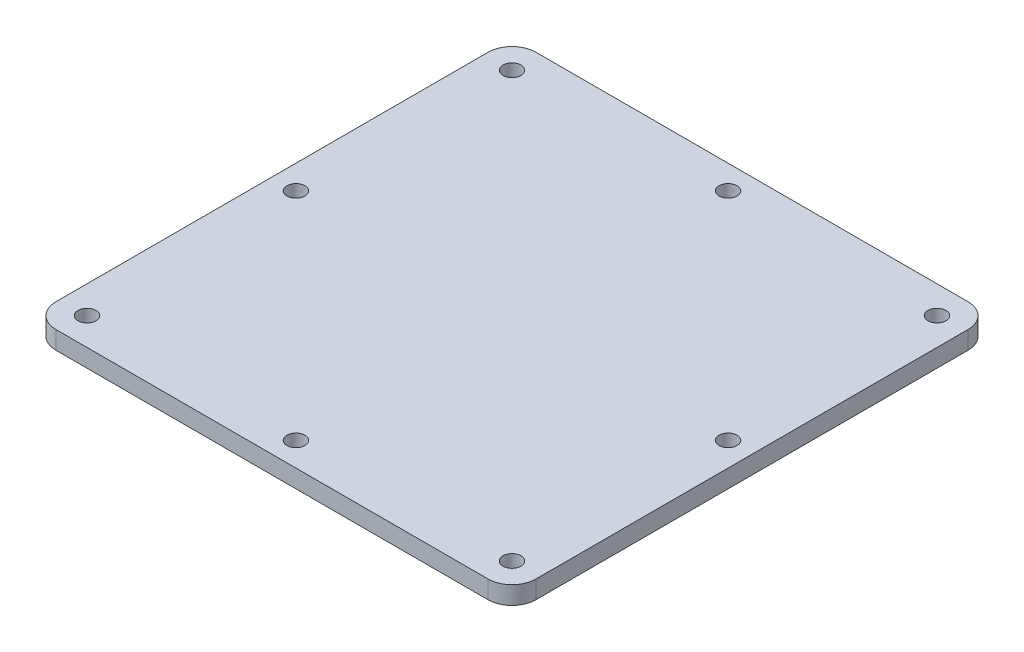
ISO-10303-21;
HEADER;
FILE_DESCRIPTION(('STEP AP214'),'2;1');
FILE_NAME('part.step','',(''),(''),'','','');
FILE_SCHEMA(('AUTOMOTIVE_DESIGN { 1 0 10303 214 1 1 1 1 }'));
ENDSEC;
DATA;
#1=APPLICATION_CONTEXT('core data for automotive mechanical design processes');
#2=APPLICATION_PROTOCOL_DEFINITION('international standard','automotive_design',2000,#1);
#3=PRODUCT_CONTEXT('',#1,'mechanical');
#4=PRODUCT('Part','Part','',(#3));
#5=PRODUCT_RELATED_PRODUCT_CATEGORY('part','',(#4));
#6=PRODUCT_DEFINITION_FORMATION('','',#4);
#7=PRODUCT_DEFINITION_CONTEXT('part definition',#1,'design');
#8=PRODUCT_DEFINITION('design','',#6,#7);
#9=PRODUCT_DEFINITION_SHAPE('','',#8);
#10=(LENGTH_UNIT() NAMED_UNIT(*) SI_UNIT(.MILLI.,.METRE.));
#11=(NAMED_UNIT(*) PLANE_ANGLE_UNIT() SI_UNIT($,.RADIAN.));
#12=(NAMED_UNIT(*) SI_UNIT($,.STERADIAN.) SOLID_ANGLE_UNIT());
#13=UNCERTAINTY_MEASURE_WITH_UNIT(LENGTH_MEASURE(1.E-05),#10,'distance_accuracy_value','');
#14=(GEOMETRIC_REPRESENTATION_CONTEXT(3) GLOBAL_UNCERTAINTY_ASSIGNED_CONTEXT((#13)) GLOBAL_UNIT_ASSIGNED_CONTEXT((#10,
#11,#12)) REPRESENTATION_CONTEXT('',''));
#15=CARTESIAN_POINT('',(0.,0.,0.));
#16=DIRECTION('',(0.,0.,1.));
#17=DIRECTION('',(1.,0.,0.));
#18=AXIS2_PLACEMENT_3D('',#15,#16,#17);
#19=CARTESIAN_POINT('',(40.,3.,-40.));
#20=DIRECTION('',(-1.,0.,0.));
#21=DIRECTION('',(0.,0.,1.));
#22=AXIS2_PLACEMENT_3D('',#19,#20,#21);
#23=PLANE('',#22);
#24=DIRECTION('',(0.,0.,-1.));
#25=VECTOR('',#24,1.);
#26=CARTESIAN_POINT('',(40.,0.,-40.));
#27=LINE('',#26,#25);
#28=CARTESIAN_POINT('',(40.,0.,36.));
#29=VERTEX_POINT('',#28);
#30=CARTESIAN_POINT('',(40.,0.,-36.));
#31=VERTEX_POINT('',#30);
#32=EDGE_CURVE('E132',#29,#31,#27,.T.);
#33=ORIENTED_EDGE('',*,*,#32,.T.);
#34=DIRECTION('',(0.,-1.,0.));
#35=VECTOR('',#34,1.);
#36=CARTESIAN_POINT('',(40.,3.,-36.));
#37=LINE('',#36,#35);
#38=CARTESIAN_POINT('',(40.,3.,-36.));
#39=VERTEX_POINT('',#38);
#40=EDGE_CURVE('E109',#31,#39,#37,.F.);
#41=ORIENTED_EDGE('',*,*,#40,.T.);
#42=DIRECTION('',(0.,0.,-1.));
#43=VECTOR('',#42,1.);
#44=CARTESIAN_POINT('',(40.,3.,-40.));
#45=LINE('',#44,#43);
#46=CARTESIAN_POINT('',(40.,3.,36.));
#47=VERTEX_POINT('',#46);
#48=EDGE_CURVE('E142',#47,#39,#45,.T.);
#49=ORIENTED_EDGE('',*,*,#48,.F.);
#50=DIRECTION('',(0.,-1.,0.));
#51=VECTOR('',#50,1.);
#52=CARTESIAN_POINT('',(40.,3.,36.));
#53=LINE('',#52,#51);
#54=EDGE_CURVE('E114',#47,#29,#53,.T.);
#55=ORIENTED_EDGE('',*,*,#54,.T.);
#56=EDGE_LOOP('',(#33,#41,#49,#55));
#57=FACE_BOUND('',#56,.T.);
#58=ADVANCED_FACE('F37',(#57),#23,.F.);
#59=CARTESIAN_POINT('',(-40.,3.,-40.));
#60=DIRECTION('',(0.,0.,1.));
#61=DIRECTION('',(1.,0.,0.));
#62=AXIS2_PLACEMENT_3D('',#59,#60,#61);
#63=PLANE('',#62);
#64=DIRECTION('',(-1.,0.,0.));
#65=VECTOR('',#64,1.);
#66=CARTESIAN_POINT('',(-40.,3.,-40.));
#67=LINE('',#66,#65);
#68=CARTESIAN_POINT('',(36.,3.,-40.));
#69=VERTEX_POINT('',#68);
#70=CARTESIAN_POINT('',(-36.,3.,-40.));
#71=VERTEX_POINT('',#70);
#72=EDGE_CURVE('E124',#69,#71,#67,.T.);
#73=ORIENTED_EDGE('',*,*,#72,.F.);
#74=DIRECTION('',(0.,-1.,0.));
#75=VECTOR('',#74,1.);
#76=CARTESIAN_POINT('',(36.,3.,-40.));
#77=LINE('',#76,#75);
#78=CARTESIAN_POINT('',(36.,0.,-40.));
#79=VERTEX_POINT('',#78);
#80=EDGE_CURVE('E108',#69,#79,#77,.T.);
#81=ORIENTED_EDGE('',*,*,#80,.T.);
#82=DIRECTION('',(-1.,0.,0.));
#83=VECTOR('',#82,1.);
#84=CARTESIAN_POINT('',(-40.,0.,-40.));
#85=LINE('',#84,#83);
#86=CARTESIAN_POINT('',(-36.,0.,-40.));
#87=VERTEX_POINT('',#86);
#88=EDGE_CURVE('E121',#79,#87,#85,.T.);
#89=ORIENTED_EDGE('',*,*,#88,.T.);
#90=DIRECTION('',(0.,-1.,0.));
#91=VECTOR('',#90,1.);
#92=CARTESIAN_POINT('',(-36.,3.,-40.));
#93=LINE('',#92,#91);
#94=EDGE_CURVE('E126',#87,#71,#93,.F.);
#95=ORIENTED_EDGE('',*,*,#94,.T.);
#96=EDGE_LOOP('',(#73,#81,#89,#95));
#97=FACE_BOUND('',#96,.T.);
#98=ADVANCED_FACE('F120',(#97),#63,.F.);
#99=CARTESIAN_POINT('',(-40.,3.,-40.));
#100=DIRECTION('',(1.,0.,0.));
#101=DIRECTION('',(0.,0.,-1.));
#102=AXIS2_PLACEMENT_3D('',#99,#100,#101);
#103=PLANE('',#102);
#104=DIRECTION('',(0.,0.,1.));
#105=VECTOR('',#104,1.);
#106=CARTESIAN_POINT('',(-40.,3.,-40.));
#107=LINE('',#106,#105);
#108=CARTESIAN_POINT('',(-40.,3.,-36.));
#109=VERTEX_POINT('',#108);
#110=CARTESIAN_POINT('',(-40.,3.,36.));
#111=VERTEX_POINT('',#110);
#112=EDGE_CURVE('E165',#109,#111,#107,.T.);
#113=ORIENTED_EDGE('',*,*,#112,.F.);
#114=DIRECTION('',(0.,-1.,0.));
#115=VECTOR('',#114,1.);
#116=CARTESIAN_POINT('',(-40.,3.,-36.));
#117=LINE('',#116,#115);
#118=CARTESIAN_POINT('',(-40.,0.,-36.));
#119=VERTEX_POINT('',#118);
#120=EDGE_CURVE('E11',#109,#119,#117,.T.);
#121=ORIENTED_EDGE('',*,*,#120,.T.);
#122=DIRECTION('',(0.,0.,1.));
#123=VECTOR('',#122,1.);
#124=CARTESIAN_POINT('',(-40.,0.,-40.));
#125=LINE('',#124,#123);
#126=CARTESIAN_POINT('',(-40.,0.,36.));
#127=VERTEX_POINT('',#126);
#128=EDGE_CURVE('E131',#119,#127,#125,.T.);
#129=ORIENTED_EDGE('',*,*,#128,.T.);
#130=DIRECTION('',(0.,-1.,0.));
#131=VECTOR('',#130,1.);
#132=CARTESIAN_POINT('',(-40.,3.,36.));
#133=LINE('',#132,#131);
#134=EDGE_CURVE('E45',#127,#111,#133,.F.);
#135=ORIENTED_EDGE('',*,*,#134,.T.);
#136=EDGE_LOOP('',(#113,#121,#129,#135));
#137=FACE_BOUND('',#136,.T.);
#138=ADVANCED_FACE('F164',(#137),#103,.F.);
#139=CARTESIAN_POINT('',(-40.,3.,40.));
#140=DIRECTION('',(0.,0.,-1.));
#141=DIRECTION('',(-1.,0.,0.));
#142=AXIS2_PLACEMENT_3D('',#139,#140,#141);
#143=PLANE('',#142);
#144=DIRECTION('',(1.,0.,0.));
#145=VECTOR('',#144,1.);
#146=CARTESIAN_POINT('',(-40.,0.,40.));
#147=LINE('',#146,#145);
#148=CARTESIAN_POINT('',(-36.,0.,40.));
#149=VERTEX_POINT('',#148);
#150=CARTESIAN_POINT('',(36.,0.,40.));
#151=VERTEX_POINT('',#150);
#152=EDGE_CURVE('E135',#149,#151,#147,.T.);
#153=ORIENTED_EDGE('',*,*,#152,.T.);
#154=DIRECTION('',(0.,-1.,0.));
#155=VECTOR('',#154,1.);
#156=CARTESIAN_POINT('',(36.,3.,40.));
#157=LINE('',#156,#155);
#158=CARTESIAN_POINT('',(36.,3.,40.));
#159=VERTEX_POINT('',#158);
#160=EDGE_CURVE('E52',#151,#159,#157,.F.);
#161=ORIENTED_EDGE('',*,*,#160,.T.);
#162=DIRECTION('',(1.,0.,0.));
#163=VECTOR('',#162,1.);
#164=CARTESIAN_POINT('',(-40.,3.,40.));
#165=LINE('',#164,#163);
#166=CARTESIAN_POINT('',(-36.,3.,40.));
#167=VERTEX_POINT('',#166);
#168=EDGE_CURVE('E143',#167,#159,#165,.T.);
#169=ORIENTED_EDGE('',*,*,#168,.F.);
#170=DIRECTION('',(0.,-1.,0.));
#171=VECTOR('',#170,1.);
#172=CARTESIAN_POINT('',(-36.,3.,40.));
#173=LINE('',#172,#171);
#174=EDGE_CURVE('E158',#167,#149,#173,.T.);
#175=ORIENTED_EDGE('',*,*,#174,.T.);
#176=EDGE_LOOP('',(#153,#161,#169,#175));
#177=FACE_BOUND('',#176,.T.);
#178=ADVANCED_FACE('F174',(#177),#143,.F.);
#179=CARTESIAN_POINT('',(0.,3.,0.));
#180=DIRECTION('',(0.,1.,0.));
#181=DIRECTION('',(0.,0.,1.));
#182=AXIS2_PLACEMENT_3D('',#179,#180,#181);
#183=PLANE('',#182);
#184=CARTESIAN_POINT('',(35.4038059222871,3.,35.4038059222878));
#185=DIRECTION('',(0.,1.,0.));
#186=DIRECTION('',(1.,0.,0.));
#187=AXIS2_PLACEMENT_3D('',#184,#185,#186);
#188=CIRCLE('',#187,1.5);
#189=CARTESIAN_POINT('',(36.9038059222871,3.,35.4038059222878));
#190=VERTEX_POINT('',#189);
#191=EDGE_CURVE('E205',#190,#190,#188,.T.);
#192=ORIENTED_EDGE('',*,*,#191,.F.);
#193=EDGE_LOOP('',(#192));
#194=FACE_BOUND('',#193,.T.);
#195=CARTESIAN_POINT('',(36.,3.,3.77079984595058E-13));
#196=DIRECTION('',(0.,1.,0.));
#197=DIRECTION('',(1.,0.,0.));
#198=AXIS2_PLACEMENT_3D('',#195,#196,#197);
#199=CIRCLE('',#198,1.5);
#200=CARTESIAN_POINT('',(37.5,3.,3.92791650619853E-13));
#201=VERTEX_POINT('',#200);
#202=EDGE_CURVE('E211',#201,#201,#199,.T.);
#203=ORIENTED_EDGE('',*,*,#202,.F.);
#204=EDGE_LOOP('',(#203));
#205=FACE_BOUND('',#204,.T.);
#206=CARTESIAN_POINT('',(35.4038059222874,3.,-35.4038059222874));
#207=DIRECTION('',(0.,1.,0.));
#208=DIRECTION('',(0.,0.,-1.));
#209=AXIS2_PLACEMENT_3D('',#206,#207,#208);
#210=CIRCLE('',#209,1.5);
#211=CARTESIAN_POINT('',(35.4038059222874,3.,-36.9038059222874));
#212=VERTEX_POINT('',#211);
#213=EDGE_CURVE('E217',#212,#212,#210,.T.);
#214=ORIENTED_EDGE('',*,*,#213,.F.);
#215=EDGE_LOOP('',(#214));
#216=FACE_BOUND('',#215,.T.);
#217=CARTESIAN_POINT('',(0.,3.,-36.));
#218=DIRECTION('',(0.,1.,0.));
#219=DIRECTION('',(0.,0.,-1.));
#220=AXIS2_PLACEMENT_3D('',#217,#218,#219);
#221=CIRCLE('',#220,1.5);
#222=CARTESIAN_POINT('',(0.,3.,-37.5));
#223=VERTEX_POINT('',#222);
#224=EDGE_CURVE('E223',#223,#223,#221,.T.);
#225=ORIENTED_EDGE('',*,*,#224,.F.);
#226=EDGE_LOOP('',(#225));
#227=FACE_BOUND('',#226,.T.);
#228=CARTESIAN_POINT('',(-35.4038059222873,3.,-35.4038059222876));
#229=DIRECTION('',(0.,1.,0.));
#230=DIRECTION('',(-1.,0.,0.));
#231=AXIS2_PLACEMENT_3D('',#228,#229,#230);
#232=CIRCLE('',#231,1.5);
#233=CARTESIAN_POINT('',(-36.9038059222873,3.,-35.4038059222876));
#234=VERTEX_POINT('',#233);
#235=EDGE_CURVE('E199',#234,#234,#232,.T.);
#236=ORIENTED_EDGE('',*,*,#235,.F.);
#237=EDGE_LOOP('',(#236));
#238=FACE_BOUND('',#237,.T.);
#239=CARTESIAN_POINT('',(-36.,3.,-1.25693328198353E-13));
#240=DIRECTION('',(0.,1.,0.));
#241=DIRECTION('',(-1.,0.,0.));
#242=AXIS2_PLACEMENT_3D('',#239,#240,#241);
#243=CIRCLE('',#242,1.5);
#244=CARTESIAN_POINT('',(-37.5,3.,-1.30930550206618E-13));
#245=VERTEX_POINT('',#244);
#246=EDGE_CURVE('E188',#245,#245,#243,.T.);
#247=ORIENTED_EDGE('',*,*,#246,.F.);
#248=EDGE_LOOP('',(#247));
#249=FACE_BOUND('',#248,.T.);
#250=CARTESIAN_POINT('',(0.,3.,36.));
#251=DIRECTION('',(0.,1.,0.));
#252=DIRECTION('',(0.,0.,1.));
#253=AXIS2_PLACEMENT_3D('',#250,#251,#252);
#254=CIRCLE('',#253,1.5);
#255=CARTESIAN_POINT('',(0.,3.,37.5));
#256=VERTEX_POINT('',#255);
#257=EDGE_CURVE('E137',#256,#256,#254,.T.);
#258=ORIENTED_EDGE('',*,*,#257,.F.);
#259=EDGE_LOOP('',(#258));
#260=FACE_BOUND('',#259,.T.);
#261=CARTESIAN_POINT('',(-35.4038059222874,3.,35.4038059222874));
#262=DIRECTION('',(0.,1.,0.));
#263=DIRECTION('',(0.,0.,1.));
#264=AXIS2_PLACEMENT_3D('',#261,#262,#263);
#265=CIRCLE('',#264,1.5);
#266=CARTESIAN_POINT('',(-35.4038059222874,3.,36.9038059222874));
#267=VERTEX_POINT('',#266);
#268=EDGE_CURVE('E187',#267,#267,#265,.T.);
#269=ORIENTED_EDGE('',*,*,#268,.F.);
#270=EDGE_LOOP('',(#269));
#271=FACE_BOUND('',#270,.T.);
#272=ORIENTED_EDGE('',*,*,#48,.T.);
#273=CARTESIAN_POINT('',(36.,3.,-36.));
#274=DIRECTION('',(0.,1.,0.));
#275=DIRECTION('',(0.,0.,1.));
#276=AXIS2_PLACEMENT_3D('',#273,#274,#275);
#277=CIRCLE('',#276,4.);
#278=EDGE_CURVE('E156',#39,#69,#277,.T.);
#279=ORIENTED_EDGE('',*,*,#278,.T.);
#280=ORIENTED_EDGE('',*,*,#72,.T.);
#281=CARTESIAN_POINT('',(-36.,3.,-36.));
#282=DIRECTION('',(0.,1.,0.));
#283=DIRECTION('',(0.,0.,1.));
#284=AXIS2_PLACEMENT_3D('',#281,#282,#283);
#285=CIRCLE('',#284,4.);
#286=EDGE_CURVE('E152',#71,#109,#285,.T.);
#287=ORIENTED_EDGE('',*,*,#286,.T.);
#288=ORIENTED_EDGE('',*,*,#112,.T.);
#289=CARTESIAN_POINT('',(-36.,3.,36.));
#290=DIRECTION('',(0.,1.,0.));
#291=DIRECTION('',(0.,0.,1.));
#292=AXIS2_PLACEMENT_3D('',#289,#290,#291);
#293=CIRCLE('',#292,4.);
#294=EDGE_CURVE('E59',#111,#167,#293,.T.);
#295=ORIENTED_EDGE('',*,*,#294,.T.);
#296=ORIENTED_EDGE('',*,*,#168,.T.);
#297=CARTESIAN_POINT('',(36.,3.,36.));
#298=DIRECTION('',(0.,1.,0.));
#299=DIRECTION('',(0.,0.,1.));
#300=AXIS2_PLACEMENT_3D('',#297,#298,#299);
#301=CIRCLE('',#300,4.);
#302=EDGE_CURVE('E154',#159,#47,#301,.T.);
#303=ORIENTED_EDGE('',*,*,#302,.T.);
#304=EDGE_LOOP('',(#272,#279,#280,#287,#288,#295,#296,#303));
#305=FACE_BOUND('',#304,.T.);
#306=ADVANCED_FACE('F169',(#194,#205,#216,#227,#238,#249,#260,#271,#305),#183,.T.);
#307=CARTESIAN_POINT('',(0.,0.,0.));
#308=DIRECTION('',(0.,1.,0.));
#309=DIRECTION('',(0.,0.,1.));
#310=AXIS2_PLACEMENT_3D('',#307,#308,#309);
#311=PLANE('',#310);
#312=CARTESIAN_POINT('',(35.4038059222871,0.,35.4038059222878));
#313=DIRECTION('',(0.,1.,0.));
#314=DIRECTION('',(1.,0.,0.));
#315=AXIS2_PLACEMENT_3D('',#312,#313,#314);
#316=CIRCLE('',#315,1.5);
#317=CARTESIAN_POINT('',(36.9038059222871,0.,35.4038059222878));
#318=VERTEX_POINT('',#317);
#319=EDGE_CURVE('E202',#318,#318,#316,.T.);
#320=ORIENTED_EDGE('',*,*,#319,.T.);
#321=EDGE_LOOP('',(#320));
#322=FACE_BOUND('',#321,.T.);
#323=CARTESIAN_POINT('',(36.,0.,3.77079984595058E-13));
#324=DIRECTION('',(0.,1.,0.));
#325=DIRECTION('',(1.,0.,0.));
#326=AXIS2_PLACEMENT_3D('',#323,#324,#325);
#327=CIRCLE('',#326,1.5);
#328=CARTESIAN_POINT('',(37.5,0.,3.92791650619853E-13));
#329=VERTEX_POINT('',#328);
#330=EDGE_CURVE('E208',#329,#329,#327,.T.);
#331=ORIENTED_EDGE('',*,*,#330,.T.);
#332=EDGE_LOOP('',(#331));
#333=FACE_BOUND('',#332,.T.);
#334=CARTESIAN_POINT('',(35.4038059222874,0.,-35.4038059222874));
#335=DIRECTION('',(0.,1.,0.));
#336=DIRECTION('',(0.,0.,-1.));
#337=AXIS2_PLACEMENT_3D('',#334,#335,#336);
#338=CIRCLE('',#337,1.5);
#339=CARTESIAN_POINT('',(35.4038059222874,0.,-36.9038059222874));
#340=VERTEX_POINT('',#339);
#341=EDGE_CURVE('E214',#340,#340,#338,.T.);
#342=ORIENTED_EDGE('',*,*,#341,.T.);
#343=EDGE_LOOP('',(#342));
#344=FACE_BOUND('',#343,.T.);
#345=CARTESIAN_POINT('',(0.,0.,-36.));
#346=DIRECTION('',(0.,1.,0.));
#347=DIRECTION('',(0.,0.,-1.));
#348=AXIS2_PLACEMENT_3D('',#345,#346,#347);
#349=CIRCLE('',#348,1.5);
#350=CARTESIAN_POINT('',(0.,0.,-37.5));
#351=VERTEX_POINT('',#350);
#352=EDGE_CURVE('E220',#351,#351,#349,.T.);
#353=ORIENTED_EDGE('',*,*,#352,.T.);
#354=EDGE_LOOP('',(#353));
#355=FACE_BOUND('',#354,.T.);
#356=CARTESIAN_POINT('',(-35.4038059222873,0.,-35.4038059222876));
#357=DIRECTION('',(0.,1.,0.));
#358=DIRECTION('',(-1.,0.,0.));
#359=AXIS2_PLACEMENT_3D('',#356,#357,#358);
#360=CIRCLE('',#359,1.5);
#361=CARTESIAN_POINT('',(-36.9038059222873,0.,-35.4038059222876));
#362=VERTEX_POINT('',#361);
#363=EDGE_CURVE('E226',#362,#362,#360,.T.);
#364=ORIENTED_EDGE('',*,*,#363,.T.);
#365=EDGE_LOOP('',(#364));
#366=FACE_BOUND('',#365,.T.);
#367=CARTESIAN_POINT('',(-36.,0.,-1.25693328198353E-13));
#368=DIRECTION('',(0.,1.,0.));
#369=DIRECTION('',(-1.,0.,0.));
#370=AXIS2_PLACEMENT_3D('',#367,#368,#369);
#371=CIRCLE('',#370,1.5);
#372=CARTESIAN_POINT('',(-37.5,0.,-1.30930550206618E-13));
#373=VERTEX_POINT('',#372);
#374=EDGE_CURVE('E196',#373,#373,#371,.T.);
#375=ORIENTED_EDGE('',*,*,#374,.T.);
#376=EDGE_LOOP('',(#375));
#377=FACE_BOUND('',#376,.T.);
#378=CARTESIAN_POINT('',(0.,0.,36.));
#379=DIRECTION('',(0.,1.,0.));
#380=DIRECTION('',(0.,0.,1.));
#381=AXIS2_PLACEMENT_3D('',#378,#379,#380);
#382=CIRCLE('',#381,1.5);
#383=CARTESIAN_POINT('',(0.,0.,37.5));
#384=VERTEX_POINT('',#383);
#385=EDGE_CURVE('E191',#384,#384,#382,.T.);
#386=ORIENTED_EDGE('',*,*,#385,.T.);
#387=EDGE_LOOP('',(#386));
#388=FACE_BOUND('',#387,.T.);
#389=CARTESIAN_POINT('',(-35.4038059222874,0.,35.4038059222874));
#390=DIRECTION('',(0.,1.,0.));
#391=DIRECTION('',(0.,0.,1.));
#392=AXIS2_PLACEMENT_3D('',#389,#390,#391);
#393=CIRCLE('',#392,1.5);
#394=CARTESIAN_POINT('',(-35.4038059222874,0.,36.9038059222874));
#395=VERTEX_POINT('',#394);
#396=EDGE_CURVE('E184',#395,#395,#393,.T.);
#397=ORIENTED_EDGE('',*,*,#396,.T.);
#398=EDGE_LOOP('',(#397));
#399=FACE_BOUND('',#398,.T.);
#400=ORIENTED_EDGE('',*,*,#88,.F.);
#401=CARTESIAN_POINT('',(36.,0.,-36.));
#402=DIRECTION('',(0.,1.,0.));
#403=DIRECTION('',(0.,0.,1.));
#404=AXIS2_PLACEMENT_3D('',#401,#402,#403);
#405=CIRCLE('',#404,4.);
#406=EDGE_CURVE('E104',#79,#31,#405,.F.);
#407=ORIENTED_EDGE('',*,*,#406,.T.);
#408=ORIENTED_EDGE('',*,*,#32,.F.);
#409=CARTESIAN_POINT('',(36.,0.,36.));
#410=DIRECTION('',(0.,1.,0.));
#411=DIRECTION('',(0.,0.,1.));
#412=AXIS2_PLACEMENT_3D('',#409,#410,#411);
#413=CIRCLE('',#412,4.);
#414=EDGE_CURVE('E115',#29,#151,#413,.F.);
#415=ORIENTED_EDGE('',*,*,#414,.T.);
#416=ORIENTED_EDGE('',*,*,#152,.F.);
#417=CARTESIAN_POINT('',(-36.,0.,36.));
#418=DIRECTION('',(0.,1.,0.));
#419=DIRECTION('',(0.,0.,1.));
#420=AXIS2_PLACEMENT_3D('',#417,#418,#419);
#421=CIRCLE('',#420,4.);
#422=EDGE_CURVE('E125',#149,#127,#421,.F.);
#423=ORIENTED_EDGE('',*,*,#422,.T.);
#424=ORIENTED_EDGE('',*,*,#128,.F.);
#425=CARTESIAN_POINT('',(-36.,0.,-36.));
#426=DIRECTION('',(0.,1.,0.));
#427=DIRECTION('',(0.,0.,1.));
#428=AXIS2_PLACEMENT_3D('',#425,#426,#427);
#429=CIRCLE('',#428,4.);
#430=EDGE_CURVE('E130',#119,#87,#429,.F.);
#431=ORIENTED_EDGE('',*,*,#430,.T.);
#432=EDGE_LOOP('',(#400,#407,#408,#415,#416,#423,#424,#431));
#433=FACE_BOUND('',#432,.T.);
#434=ADVANCED_FACE('F128',(#322,#333,#344,#355,#366,#377,#388,#399,#433),#311,.F.);
#435=CARTESIAN_POINT('',(-35.4038059222874,3.,35.4038059222874));
#436=DIRECTION('',(0.,-1.,0.));
#437=DIRECTION('',(0.,0.,-1.));
#438=AXIS2_PLACEMENT_3D('',#435,#436,#437);
#439=CYLINDRICAL_SURFACE('',#438,1.5);
#440=ORIENTED_EDGE('',*,*,#268,.T.);
#441=EDGE_LOOP('',(#440));
#442=FACE_BOUND('',#441,.T.);
#443=ORIENTED_EDGE('',*,*,#396,.F.);
#444=EDGE_LOOP('',(#443));
#445=FACE_BOUND('',#444,.T.);
#446=ADVANCED_FACE('F245',(#442,#445),#439,.F.);
#447=CARTESIAN_POINT('',(0.,3.,36.));
#448=DIRECTION('',(0.,-1.,0.));
#449=DIRECTION('',(0.,0.,-1.));
#450=AXIS2_PLACEMENT_3D('',#447,#448,#449);
#451=CYLINDRICAL_SURFACE('',#450,1.5);
#452=ORIENTED_EDGE('',*,*,#257,.T.);
#453=EDGE_LOOP('',(#452));
#454=FACE_BOUND('',#453,.T.);
#455=ORIENTED_EDGE('',*,*,#385,.F.);
#456=EDGE_LOOP('',(#455));
#457=FACE_BOUND('',#456,.T.);
#458=ADVANCED_FACE('F248',(#454,#457),#451,.F.);
#459=CARTESIAN_POINT('',(-36.,3.,-1.25693328198353E-13));
#460=DIRECTION('',(0.,-1.,0.));
#461=DIRECTION('',(0.,0.,-1.));
#462=AXIS2_PLACEMENT_3D('',#459,#460,#461);
#463=CYLINDRICAL_SURFACE('',#462,1.5);
#464=ORIENTED_EDGE('',*,*,#246,.T.);
#465=EDGE_LOOP('',(#464));
#466=FACE_BOUND('',#465,.T.);
#467=ORIENTED_EDGE('',*,*,#374,.F.);
#468=EDGE_LOOP('',(#467));
#469=FACE_BOUND('',#468,.T.);
#470=ADVANCED_FACE('F378',(#466,#469),#463,.F.);
#471=CARTESIAN_POINT('',(-35.4038059222873,3.,-35.4038059222876));
#472=DIRECTION('',(0.,-1.,0.));
#473=DIRECTION('',(0.,0.,-1.));
#474=AXIS2_PLACEMENT_3D('',#471,#472,#473);
#475=CYLINDRICAL_SURFACE('',#474,1.5);
#476=ORIENTED_EDGE('',*,*,#235,.T.);
#477=EDGE_LOOP('',(#476));
#478=FACE_BOUND('',#477,.T.);
#479=ORIENTED_EDGE('',*,*,#363,.F.);
#480=EDGE_LOOP('',(#479));
#481=FACE_BOUND('',#480,.T.);
#482=ADVANCED_FACE('F232',(#478,#481),#475,.F.);
#483=CARTESIAN_POINT('',(0.,3.,-36.));
#484=DIRECTION('',(0.,-1.,0.));
#485=DIRECTION('',(0.,0.,-1.));
#486=AXIS2_PLACEMENT_3D('',#483,#484,#485);
#487=CYLINDRICAL_SURFACE('',#486,1.5);
#488=ORIENTED_EDGE('',*,*,#224,.T.);
#489=EDGE_LOOP('',(#488));
#490=FACE_BOUND('',#489,.T.);
#491=ORIENTED_EDGE('',*,*,#352,.F.);
#492=EDGE_LOOP('',(#491));
#493=FACE_BOUND('',#492,.T.);
#494=ADVANCED_FACE('F359',(#490,#493),#487,.F.);
#495=CARTESIAN_POINT('',(35.4038059222874,3.,-35.4038059222874));
#496=DIRECTION('',(0.,-1.,0.));
#497=DIRECTION('',(0.,0.,-1.));
#498=AXIS2_PLACEMENT_3D('',#495,#496,#497);
#499=CYLINDRICAL_SURFACE('',#498,1.5);
#500=ORIENTED_EDGE('',*,*,#213,.T.);
#501=EDGE_LOOP('',(#500));
#502=FACE_BOUND('',#501,.T.);
#503=ORIENTED_EDGE('',*,*,#341,.F.);
#504=EDGE_LOOP('',(#503));
#505=FACE_BOUND('',#504,.T.);
#506=ADVANCED_FACE('F349',(#502,#505),#499,.F.);
#507=CARTESIAN_POINT('',(36.,3.,3.77079984595058E-13));
#508=DIRECTION('',(0.,-1.,0.));
#509=DIRECTION('',(0.,0.,-1.));
#510=AXIS2_PLACEMENT_3D('',#507,#508,#509);
#511=CYLINDRICAL_SURFACE('',#510,1.5);
#512=ORIENTED_EDGE('',*,*,#202,.T.);
#513=EDGE_LOOP('',(#512));
#514=FACE_BOUND('',#513,.T.);
#515=ORIENTED_EDGE('',*,*,#330,.F.);
#516=EDGE_LOOP('',(#515));
#517=FACE_BOUND('',#516,.T.);
#518=ADVANCED_FACE('F339',(#514,#517),#511,.F.);
#519=CARTESIAN_POINT('',(35.4038059222871,3.,35.4038059222878));
#520=DIRECTION('',(0.,-1.,0.));
#521=DIRECTION('',(0.,0.,-1.));
#522=AXIS2_PLACEMENT_3D('',#519,#520,#521);
#523=CYLINDRICAL_SURFACE('',#522,1.5);
#524=ORIENTED_EDGE('',*,*,#191,.T.);
#525=EDGE_LOOP('',(#524));
#526=FACE_BOUND('',#525,.T.);
#527=ORIENTED_EDGE('',*,*,#319,.F.);
#528=EDGE_LOOP('',(#527));
#529=FACE_BOUND('',#528,.T.);
#530=ADVANCED_FACE('F269',(#526,#529),#523,.F.);
#531=CARTESIAN_POINT('',(36.,3.,-36.));
#532=DIRECTION('',(0.,-1.,0.));
#533=DIRECTION('',(0.,0.,-1.));
#534=AXIS2_PLACEMENT_3D('',#531,#532,#533);
#535=CYLINDRICAL_SURFACE('',#534,4.);
#536=ORIENTED_EDGE('',*,*,#278,.F.);
#537=ORIENTED_EDGE('',*,*,#40,.F.);
#538=ORIENTED_EDGE('',*,*,#406,.F.);
#539=ORIENTED_EDGE('',*,*,#80,.F.);
#540=EDGE_LOOP('',(#536,#537,#538,#539));
#541=FACE_BOUND('',#540,.T.);
#542=ADVANCED_FACE('F107',(#541),#535,.T.);
#543=CARTESIAN_POINT('',(36.,3.,36.));
#544=DIRECTION('',(0.,-1.,0.));
#545=DIRECTION('',(0.,0.,-1.));
#546=AXIS2_PLACEMENT_3D('',#543,#544,#545);
#547=CYLINDRICAL_SURFACE('',#546,4.);
#548=ORIENTED_EDGE('',*,*,#302,.F.);
#549=ORIENTED_EDGE('',*,*,#160,.F.);
#550=ORIENTED_EDGE('',*,*,#414,.F.);
#551=ORIENTED_EDGE('',*,*,#54,.F.);
#552=EDGE_LOOP('',(#548,#549,#550,#551));
#553=FACE_BOUND('',#552,.T.);
#554=ADVANCED_FACE('F178',(#553),#547,.T.);
#555=CARTESIAN_POINT('',(-36.,3.,-36.));
#556=DIRECTION('',(0.,-1.,0.));
#557=DIRECTION('',(0.,0.,-1.));
#558=AXIS2_PLACEMENT_3D('',#555,#556,#557);
#559=CYLINDRICAL_SURFACE('',#558,4.);
#560=ORIENTED_EDGE('',*,*,#286,.F.);
#561=ORIENTED_EDGE('',*,*,#94,.F.);
#562=ORIENTED_EDGE('',*,*,#430,.F.);
#563=ORIENTED_EDGE('',*,*,#120,.F.);
#564=EDGE_LOOP('',(#560,#561,#562,#563));
#565=FACE_BOUND('',#564,.T.);
#566=ADVANCED_FACE('F271',(#565),#559,.T.);
#567=CARTESIAN_POINT('',(-36.,3.,36.));
#568=DIRECTION('',(0.,-1.,0.));
#569=DIRECTION('',(0.,0.,-1.));
#570=AXIS2_PLACEMENT_3D('',#567,#568,#569);
#571=CYLINDRICAL_SURFACE('',#570,4.);
#572=ORIENTED_EDGE('',*,*,#294,.F.);
#573=ORIENTED_EDGE('',*,*,#134,.F.);
#574=ORIENTED_EDGE('',*,*,#422,.F.);
#575=ORIENTED_EDGE('',*,*,#174,.F.);
#576=EDGE_LOOP('',(#572,#573,#574,#575));
#577=FACE_BOUND('',#576,.T.);
#578=ADVANCED_FACE('F39',(#577),#571,.T.);
#579=CLOSED_SHELL('',(#58,#98,#138,#178,#306,#434,#446,#458,#470,#482,#494,#506,#518,#530,#542,
#554,#566,#578));
#580=MANIFOLD_SOLID_BREP('B2',#579);
#581=ADVANCED_BREP_SHAPE_REPRESENTATION('',(#18,#580),#14);
#582=SHAPE_DEFINITION_REPRESENTATION(#9,#581);
ENDSEC;
END-ISO-10303-21;
